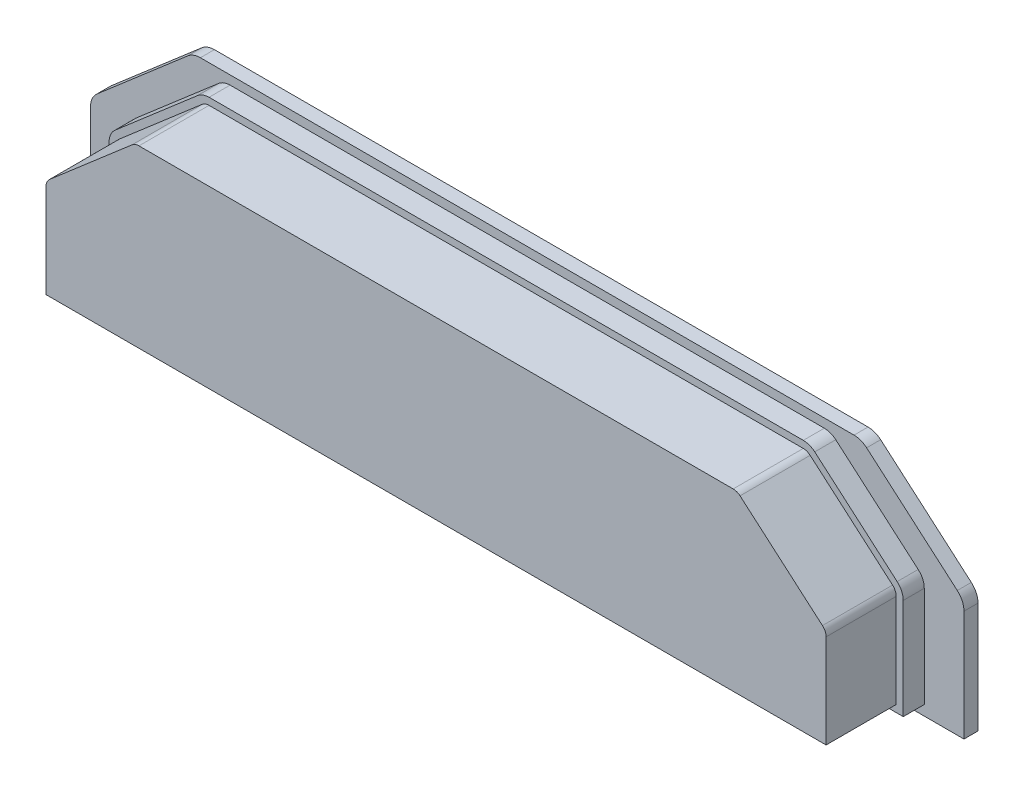
ISO-10303-21;
HEADER;
FILE_DESCRIPTION(('STEP AP214'),'2;1');
FILE_NAME('part.step','',(''),(''),'','','');
FILE_SCHEMA(('AUTOMOTIVE_DESIGN { 1 0 10303 214 1 1 1 1 }'));
ENDSEC;
DATA;
#1=APPLICATION_CONTEXT('core data for automotive mechanical design processes');
#2=APPLICATION_PROTOCOL_DEFINITION('international standard','automotive_design',2000,#1);
#3=PRODUCT_CONTEXT('',#1,'mechanical');
#4=PRODUCT('Part','Part','',(#3));
#5=PRODUCT_RELATED_PRODUCT_CATEGORY('part','',(#4));
#6=PRODUCT_DEFINITION_FORMATION('','',#4);
#7=PRODUCT_DEFINITION_CONTEXT('part definition',#1,'design');
#8=PRODUCT_DEFINITION('design','',#6,#7);
#9=PRODUCT_DEFINITION_SHAPE('','',#8);
#10=(LENGTH_UNIT() NAMED_UNIT(*) SI_UNIT(.MILLI.,.METRE.));
#11=(NAMED_UNIT(*) PLANE_ANGLE_UNIT() SI_UNIT($,.RADIAN.));
#12=(NAMED_UNIT(*) SI_UNIT($,.STERADIAN.) SOLID_ANGLE_UNIT());
#13=UNCERTAINTY_MEASURE_WITH_UNIT(LENGTH_MEASURE(1.E-05),#10,'distance_accuracy_value','');
#14=(GEOMETRIC_REPRESENTATION_CONTEXT(3) GLOBAL_UNCERTAINTY_ASSIGNED_CONTEXT((#13)) GLOBAL_UNIT_ASSIGNED_CONTEXT((#10,
#11,#12)) REPRESENTATION_CONTEXT('',''));
#15=CARTESIAN_POINT('',(0.,0.,0.));
#16=DIRECTION('',(0.,0.,1.));
#17=DIRECTION('',(1.,0.,0.));
#18=AXIS2_PLACEMENT_3D('',#15,#16,#17);
#19=CARTESIAN_POINT('',(56.625,-26.9999999999999,3.));
#20=DIRECTION('',(-1.,0.,0.));
#21=DIRECTION('',(0.,0.,1.));
#22=AXIS2_PLACEMENT_3D('',#19,#20,#21);
#23=PLANE('',#22);
#24=DIRECTION('',(0.,1.,0.));
#25=VECTOR('',#24,1.);
#26=CARTESIAN_POINT('',(56.625,-26.9999999999999,0.));
#27=LINE('',#26,#25);
#28=CARTESIAN_POINT('',(56.625,-26.9999999999999,0.));
#29=VERTEX_POINT('',#28);
#30=CARTESIAN_POINT('',(56.625,-12.6446300735362,0.));
#31=VERTEX_POINT('',#30);
#32=EDGE_CURVE('E378',#29,#31,#27,.T.);
#33=ORIENTED_EDGE('',*,*,#32,.T.);
#34=DIRECTION('',(0.,0.,-1.));
#35=VECTOR('',#34,1.);
#36=CARTESIAN_POINT('',(56.625,-12.6446300735362,3.));
#37=LINE('',#36,#35);
#38=CARTESIAN_POINT('',(56.625,-12.6446300735362,3.));
#39=VERTEX_POINT('',#38);
#40=EDGE_CURVE('E11',#39,#31,#37,.T.);
#41=ORIENTED_EDGE('',*,*,#40,.F.);
#42=DIRECTION('',(0.,1.,0.));
#43=VECTOR('',#42,1.);
#44=CARTESIAN_POINT('',(56.625,-26.9999999999999,3.));
#45=LINE('',#44,#43);
#46=CARTESIAN_POINT('',(56.625,-26.9999999999999,3.));
#47=VERTEX_POINT('',#46);
#48=EDGE_CURVE('E379',#47,#39,#45,.T.);
#49=ORIENTED_EDGE('',*,*,#48,.F.);
#50=DIRECTION('',(0.,0.,-1.));
#51=VECTOR('',#50,1.);
#52=CARTESIAN_POINT('',(56.625,-26.9999999999999,3.));
#53=LINE('',#52,#51);
#54=EDGE_CURVE('E411',#47,#29,#53,.T.);
#55=ORIENTED_EDGE('',*,*,#54,.T.);
#56=EDGE_LOOP('',(#33,#41,#49,#55));
#57=FACE_BOUND('',#56,.T.);
#58=ADVANCED_FACE('F43',(#57),#23,.F.);
#59=CARTESIAN_POINT('',(54.125,-12.6446300735362,3.));
#60=DIRECTION('',(0.,0.,-1.));
#61=DIRECTION('',(-1.,0.,0.));
#62=AXIS2_PLACEMENT_3D('',#59,#60,#61);
#63=CYLINDRICAL_SURFACE('',#62,2.5);
#64=CARTESIAN_POINT('',(54.125,-12.6446300735362,0.));
#65=DIRECTION('',(0.,0.,1.));
#66=DIRECTION('',(1.,0.,0.));
#67=AXIS2_PLACEMENT_3D('',#64,#65,#66);
#68=CIRCLE('',#67,2.5);
#69=CARTESIAN_POINT('',(55.7585005575696,-10.752098454667,0.));
#70=VERTEX_POINT('',#69);
#71=EDGE_CURVE('E415',#31,#70,#68,.T.);
#72=ORIENTED_EDGE('',*,*,#71,.T.);
#73=DIRECTION('',(0.,0.,-1.));
#74=VECTOR('',#73,1.);
#75=CARTESIAN_POINT('',(55.7585005575696,-10.752098454667,3.));
#76=LINE('',#75,#74);
#77=CARTESIAN_POINT('',(55.7585005575696,-10.752098454667,3.));
#78=VERTEX_POINT('',#77);
#79=EDGE_CURVE('E51',#78,#70,#76,.T.);
#80=ORIENTED_EDGE('',*,*,#79,.F.);
#81=CARTESIAN_POINT('',(54.125,-12.6446300735362,3.));
#82=DIRECTION('',(0.,0.,1.));
#83=DIRECTION('',(1.,0.,0.));
#84=AXIS2_PLACEMENT_3D('',#81,#82,#83);
#85=CIRCLE('',#84,2.5);
#86=EDGE_CURVE('E383',#39,#78,#85,.T.);
#87=ORIENTED_EDGE('',*,*,#86,.F.);
#88=ORIENTED_EDGE('',*,*,#40,.T.);
#89=EDGE_LOOP('',(#72,#80,#87,#88));
#90=FACE_BOUND('',#89,.T.);
#91=ADVANCED_FACE('F488',(#90),#63,.T.);
#92=CARTESIAN_POINT('',(55.7585005575696,-10.752098454667,3.));
#93=DIRECTION('',(-0.653400223027825,-0.757012647547707,0.));
#94=DIRECTION('',(0.757012647547707,-0.653400223027825,0.));
#95=AXIS2_PLACEMENT_3D('',#92,#93,#94);
#96=PLANE('',#95);
#97=DIRECTION('',(-0.757012647547707,0.653400223027825,0.));
#98=VECTOR('',#97,1.);
#99=CARTESIAN_POINT('',(55.7585005575696,-10.752098454667,0.));
#100=LINE('',#99,#98);
#101=CARTESIAN_POINT('',(44.0051937791102,-0.607468381130697,0.));
#102=VERTEX_POINT('',#101);
#103=EDGE_CURVE('E419',#70,#102,#100,.T.);
#104=ORIENTED_EDGE('',*,*,#103,.T.);
#105=DIRECTION('',(0.,0.,-1.));
#106=VECTOR('',#105,1.);
#107=CARTESIAN_POINT('',(44.0051937791102,-0.607468381130697,3.));
#108=LINE('',#107,#106);
#109=CARTESIAN_POINT('',(44.0051937791102,-0.607468381130697,3.));
#110=VERTEX_POINT('',#109);
#111=EDGE_CURVE('E477',#110,#102,#108,.T.);
#112=ORIENTED_EDGE('',*,*,#111,.F.);
#113=DIRECTION('',(-0.757012647547707,0.653400223027825,0.));
#114=VECTOR('',#113,1.);
#115=CARTESIAN_POINT('',(55.7585005575696,-10.752098454667,3.));
#116=LINE('',#115,#114);
#117=EDGE_CURVE('E387',#78,#110,#116,.T.);
#118=ORIENTED_EDGE('',*,*,#117,.F.);
#119=ORIENTED_EDGE('',*,*,#79,.T.);
#120=EDGE_LOOP('',(#104,#112,#118,#119));
#121=FACE_BOUND('',#120,.T.);
#122=ADVANCED_FACE('F485',(#121),#96,.F.);
#123=CARTESIAN_POINT('',(42.3716932215407,-2.49999999999995,3.));
#124=DIRECTION('',(0.,0.,-1.));
#125=DIRECTION('',(-1.,0.,0.));
#126=AXIS2_PLACEMENT_3D('',#123,#124,#125);
#127=CYLINDRICAL_SURFACE('',#126,2.49999999999997);
#128=CARTESIAN_POINT('',(42.3716932215407,-2.49999999999995,0.));
#129=DIRECTION('',(0.,0.,1.));
#130=DIRECTION('',(1.,0.,0.));
#131=AXIS2_PLACEMENT_3D('',#128,#129,#130);
#132=CIRCLE('',#131,2.49999999999997);
#133=CARTESIAN_POINT('',(42.3716932215407,0.,0.));
#134=VERTEX_POINT('',#133);
#135=EDGE_CURVE('E423',#102,#134,#132,.T.);
#136=ORIENTED_EDGE('',*,*,#135,.T.);
#137=DIRECTION('',(0.,0.,-1.));
#138=VECTOR('',#137,1.);
#139=CARTESIAN_POINT('',(42.3716932215407,0.,3.));
#140=LINE('',#139,#138);
#141=CARTESIAN_POINT('',(42.3716932215407,0.,3.));
#142=VERTEX_POINT('',#141);
#143=EDGE_CURVE('E473',#142,#134,#140,.T.);
#144=ORIENTED_EDGE('',*,*,#143,.F.);
#145=CARTESIAN_POINT('',(42.3716932215407,-2.49999999999995,3.));
#146=DIRECTION('',(0.,0.,1.));
#147=DIRECTION('',(1.,0.,0.));
#148=AXIS2_PLACEMENT_3D('',#145,#146,#147);
#149=CIRCLE('',#148,2.49999999999997);
#150=EDGE_CURVE('E390',#110,#142,#149,.T.);
#151=ORIENTED_EDGE('',*,*,#150,.F.);
#152=ORIENTED_EDGE('',*,*,#111,.T.);
#153=EDGE_LOOP('',(#136,#144,#151,#152));
#154=FACE_BOUND('',#153,.T.);
#155=ADVANCED_FACE('F495',(#154),#127,.T.);
#156=CARTESIAN_POINT('',(42.3716932215407,0.,3.));
#157=DIRECTION('',(0.,-1.,0.));
#158=DIRECTION('',(1.,0.,0.));
#159=AXIS2_PLACEMENT_3D('',#156,#157,#158);
#160=PLANE('',#159);
#161=DIRECTION('',(-1.,0.,0.));
#162=VECTOR('',#161,1.);
#163=CARTESIAN_POINT('',(42.3716932215407,0.,0.));
#164=LINE('',#163,#162);
#165=CARTESIAN_POINT('',(-42.3716932215407,0.,0.));
#166=VERTEX_POINT('',#165);
#167=EDGE_CURVE('E427',#134,#166,#164,.T.);
#168=ORIENTED_EDGE('',*,*,#167,.T.);
#169=DIRECTION('',(0.,0.,-1.));
#170=VECTOR('',#169,1.);
#171=CARTESIAN_POINT('',(-42.3716932215407,0.,3.));
#172=LINE('',#171,#170);
#173=CARTESIAN_POINT('',(-42.3716932215407,0.,3.));
#174=VERTEX_POINT('',#173);
#175=EDGE_CURVE('E469',#174,#166,#172,.T.);
#176=ORIENTED_EDGE('',*,*,#175,.F.);
#177=DIRECTION('',(-1.,0.,0.));
#178=VECTOR('',#177,1.);
#179=CARTESIAN_POINT('',(42.3716932215407,0.,3.));
#180=LINE('',#179,#178);
#181=EDGE_CURVE('E393',#142,#174,#180,.T.);
#182=ORIENTED_EDGE('',*,*,#181,.F.);
#183=ORIENTED_EDGE('',*,*,#143,.T.);
#184=EDGE_LOOP('',(#168,#176,#182,#183));
#185=FACE_BOUND('',#184,.T.);
#186=ADVANCED_FACE('F499',(#185),#160,.F.);
#187=CARTESIAN_POINT('',(-42.3716932215407,-2.49999999999995,3.));
#188=DIRECTION('',(0.,0.,-1.));
#189=DIRECTION('',(-1.,0.,0.));
#190=AXIS2_PLACEMENT_3D('',#187,#188,#189);
#191=CYLINDRICAL_SURFACE('',#190,2.4999999999999);
#192=CARTESIAN_POINT('',(-42.3716932215407,-2.49999999999995,0.));
#193=DIRECTION('',(0.,0.,1.));
#194=DIRECTION('',(1.,0.,0.));
#195=AXIS2_PLACEMENT_3D('',#192,#193,#194);
#196=CIRCLE('',#195,2.4999999999999);
#197=CARTESIAN_POINT('',(-44.0051937791101,-0.607468381130795,0.));
#198=VERTEX_POINT('',#197);
#199=EDGE_CURVE('E431',#166,#198,#196,.T.);
#200=ORIENTED_EDGE('',*,*,#199,.T.);
#201=DIRECTION('',(0.,0.,-1.));
#202=VECTOR('',#201,1.);
#203=CARTESIAN_POINT('',(-44.0051937791101,-0.607468381130795,3.));
#204=LINE('',#203,#202);
#205=CARTESIAN_POINT('',(-44.0051937791101,-0.607468381130795,3.));
#206=VERTEX_POINT('',#205);
#207=EDGE_CURVE('E465',#206,#198,#204,.T.);
#208=ORIENTED_EDGE('',*,*,#207,.F.);
#209=CARTESIAN_POINT('',(-42.3716932215407,-2.49999999999995,3.));
#210=DIRECTION('',(0.,0.,1.));
#211=DIRECTION('',(1.,0.,0.));
#212=AXIS2_PLACEMENT_3D('',#209,#210,#211);
#213=CIRCLE('',#212,2.4999999999999);
#214=EDGE_CURVE('E396',#174,#206,#213,.T.);
#215=ORIENTED_EDGE('',*,*,#214,.F.);
#216=ORIENTED_EDGE('',*,*,#175,.T.);
#217=EDGE_LOOP('',(#200,#208,#215,#216));
#218=FACE_BOUND('',#217,.T.);
#219=ADVANCED_FACE('F524',(#218),#191,.T.);
#220=CARTESIAN_POINT('',(-44.0051937791101,-0.607468381130795,3.));
#221=DIRECTION('',(0.653400223027825,-0.757012647547707,0.));
#222=DIRECTION('',(0.757012647547707,0.653400223027825,0.));
#223=AXIS2_PLACEMENT_3D('',#220,#221,#222);
#224=PLANE('',#223);
#225=DIRECTION('',(-0.757012647547707,-0.653400223027825,0.));
#226=VECTOR('',#225,1.);
#227=CARTESIAN_POINT('',(-44.0051937791101,-0.607468381130795,0.));
#228=LINE('',#227,#226);
#229=CARTESIAN_POINT('',(-55.7585005575695,-10.752098454667,0.));
#230=VERTEX_POINT('',#229);
#231=EDGE_CURVE('E435',#198,#230,#228,.T.);
#232=ORIENTED_EDGE('',*,*,#231,.T.);
#233=DIRECTION('',(0.,0.,-1.));
#234=VECTOR('',#233,1.);
#235=CARTESIAN_POINT('',(-55.7585005575695,-10.752098454667,3.));
#236=LINE('',#235,#234);
#237=CARTESIAN_POINT('',(-55.7585005575695,-10.752098454667,3.));
#238=VERTEX_POINT('',#237);
#239=EDGE_CURVE('E461',#238,#230,#236,.T.);
#240=ORIENTED_EDGE('',*,*,#239,.F.);
#241=DIRECTION('',(-0.757012647547707,-0.653400223027825,0.));
#242=VECTOR('',#241,1.);
#243=CARTESIAN_POINT('',(-44.0051937791101,-0.607468381130795,3.));
#244=LINE('',#243,#242);
#245=EDGE_CURVE('E399',#206,#238,#244,.T.);
#246=ORIENTED_EDGE('',*,*,#245,.F.);
#247=ORIENTED_EDGE('',*,*,#207,.T.);
#248=EDGE_LOOP('',(#232,#240,#246,#247));
#249=FACE_BOUND('',#248,.T.);
#250=ADVANCED_FACE('F521',(#249),#224,.F.);
#251=CARTESIAN_POINT('',(-54.125,-12.6446300735362,3.));
#252=DIRECTION('',(0.,0.,-1.));
#253=DIRECTION('',(-1.,0.,0.));
#254=AXIS2_PLACEMENT_3D('',#251,#252,#253);
#255=CYLINDRICAL_SURFACE('',#254,2.49999999999993);
#256=CARTESIAN_POINT('',(-54.125,-12.6446300735362,0.));
#257=DIRECTION('',(0.,0.,1.));
#258=DIRECTION('',(1.,0.,0.));
#259=AXIS2_PLACEMENT_3D('',#256,#257,#258);
#260=CIRCLE('',#259,2.49999999999993);
#261=CARTESIAN_POINT('',(-56.625,-12.6446300735362,0.));
#262=VERTEX_POINT('',#261);
#263=EDGE_CURVE('E439',#230,#262,#260,.T.);
#264=ORIENTED_EDGE('',*,*,#263,.T.);
#265=DIRECTION('',(0.,0.,-1.));
#266=VECTOR('',#265,1.);
#267=CARTESIAN_POINT('',(-56.625,-12.6446300735362,3.));
#268=LINE('',#267,#266);
#269=CARTESIAN_POINT('',(-56.625,-12.6446300735362,3.));
#270=VERTEX_POINT('',#269);
#271=EDGE_CURVE('E457',#270,#262,#268,.T.);
#272=ORIENTED_EDGE('',*,*,#271,.F.);
#273=CARTESIAN_POINT('',(-54.125,-12.6446300735362,3.));
#274=DIRECTION('',(0.,0.,1.));
#275=DIRECTION('',(1.,0.,0.));
#276=AXIS2_PLACEMENT_3D('',#273,#274,#275);
#277=CIRCLE('',#276,2.49999999999993);
#278=EDGE_CURVE('E402',#238,#270,#277,.T.);
#279=ORIENTED_EDGE('',*,*,#278,.F.);
#280=ORIENTED_EDGE('',*,*,#239,.T.);
#281=EDGE_LOOP('',(#264,#272,#279,#280));
#282=FACE_BOUND('',#281,.T.);
#283=ADVANCED_FACE('F518',(#282),#255,.T.);
#284=CARTESIAN_POINT('',(-56.625,-12.6446300735362,3.));
#285=DIRECTION('',(1.,0.,0.));
#286=DIRECTION('',(0.,1.,0.));
#287=AXIS2_PLACEMENT_3D('',#284,#285,#286);
#288=PLANE('',#287);
#289=DIRECTION('',(0.,-1.,0.));
#290=VECTOR('',#289,1.);
#291=CARTESIAN_POINT('',(-56.625,-12.6446300735362,0.));
#292=LINE('',#291,#290);
#293=CARTESIAN_POINT('',(-56.625,-26.9999999999999,0.));
#294=VERTEX_POINT('',#293);
#295=EDGE_CURVE('E443',#262,#294,#292,.T.);
#296=ORIENTED_EDGE('',*,*,#295,.T.);
#297=DIRECTION('',(0.,0.,-1.));
#298=VECTOR('',#297,1.);
#299=CARTESIAN_POINT('',(-56.625,-26.9999999999999,3.));
#300=LINE('',#299,#298);
#301=CARTESIAN_POINT('',(-56.625,-26.9999999999999,3.));
#302=VERTEX_POINT('',#301);
#303=EDGE_CURVE('E453',#302,#294,#300,.T.);
#304=ORIENTED_EDGE('',*,*,#303,.F.);
#305=DIRECTION('',(0.,-1.,0.));
#306=VECTOR('',#305,1.);
#307=CARTESIAN_POINT('',(-56.625,-12.6446300735362,3.));
#308=LINE('',#307,#306);
#309=EDGE_CURVE('E405',#270,#302,#308,.T.);
#310=ORIENTED_EDGE('',*,*,#309,.F.);
#311=ORIENTED_EDGE('',*,*,#271,.T.);
#312=EDGE_LOOP('',(#296,#304,#310,#311));
#313=FACE_BOUND('',#312,.T.);
#314=ADVANCED_FACE('F513',(#313),#288,.F.);
#315=CARTESIAN_POINT('',(-56.625,-26.9999999999999,3.));
#316=DIRECTION('',(0.,1.,0.));
#317=DIRECTION('',(0.,0.,1.));
#318=AXIS2_PLACEMENT_3D('',#315,#316,#317);
#319=PLANE('',#318);
#320=DIRECTION('',(1.,0.,0.));
#321=VECTOR('',#320,1.);
#322=CARTESIAN_POINT('',(-56.625,-26.9999999999999,0.));
#323=LINE('',#322,#321);
#324=EDGE_CURVE('E384',#294,#29,#323,.T.);
#325=ORIENTED_EDGE('',*,*,#324,.T.);
#326=ORIENTED_EDGE('',*,*,#54,.F.);
#327=DIRECTION('',(1.,0.,0.));
#328=VECTOR('',#327,1.);
#329=CARTESIAN_POINT('',(-56.625,-26.9999999999999,3.));
#330=LINE('',#329,#328);
#331=EDGE_CURVE('E408',#302,#47,#330,.T.);
#332=ORIENTED_EDGE('',*,*,#331,.F.);
#333=ORIENTED_EDGE('',*,*,#303,.T.);
#334=EDGE_LOOP('',(#325,#326,#332,#333));
#335=FACE_BOUND('',#334,.T.);
#336=ADVANCED_FACE('F510',(#335),#319,.F.);
#337=CARTESIAN_POINT('',(54.125,-12.6446300735362,3.));
#338=DIRECTION('',(0.,0.,1.));
#339=DIRECTION('',(1.,0.,0.));
#340=AXIS2_PLACEMENT_3D('',#337,#338,#339);
#341=PLANE('',#340);
#342=DIRECTION('',(1.,0.,0.));
#343=VECTOR('',#342,1.);
#344=CARTESIAN_POINT('',(-55.625,-25.9999999999999,3.));
#345=LINE('',#344,#343);
#346=CARTESIAN_POINT('',(-55.625,-25.9999999999999,3.));
#347=VERTEX_POINT('',#346);
#348=CARTESIAN_POINT('',(55.625,-25.9999999999999,3.));
#349=VERTEX_POINT('',#348);
#350=EDGE_CURVE('E58',#347,#349,#345,.T.);
#351=ORIENTED_EDGE('',*,*,#350,.F.);
#352=DIRECTION('',(0.,-1.,0.));
#353=VECTOR('',#352,1.);
#354=CARTESIAN_POINT('',(-55.625,-12.6446300735362,3.));
#355=LINE('',#354,#353);
#356=CARTESIAN_POINT('',(-55.625,-12.6446300735362,3.));
#357=VERTEX_POINT('',#356);
#358=EDGE_CURVE('E62',#357,#347,#355,.T.);
#359=ORIENTED_EDGE('',*,*,#358,.F.);
#360=CARTESIAN_POINT('',(-54.125,-12.6446300735362,3.));
#361=DIRECTION('',(0.,0.,1.));
#362=DIRECTION('',(1.,0.,0.));
#363=AXIS2_PLACEMENT_3D('',#360,#361,#362);
#364=CIRCLE('',#363,1.49999999999995);
#365=CARTESIAN_POINT('',(-55.1051003345417,-11.5091111022147,3.));
#366=VERTEX_POINT('',#365);
#367=EDGE_CURVE('E334',#366,#357,#364,.T.);
#368=ORIENTED_EDGE('',*,*,#367,.F.);
#369=DIRECTION('',(-0.757012647547709,-0.653400223027822,0.));
#370=VECTOR('',#369,1.);
#371=CARTESIAN_POINT('',(-43.3517935560823,-1.36448102867848,3.));
#372=LINE('',#371,#370);
#373=CARTESIAN_POINT('',(-43.3517935560823,-1.36448102867847,3.));
#374=VERTEX_POINT('',#373);
#375=EDGE_CURVE('E330',#374,#366,#372,.T.);
#376=ORIENTED_EDGE('',*,*,#375,.F.);
#377=CARTESIAN_POINT('',(-42.3716932215407,-2.49999999999995,3.));
#378=DIRECTION('',(0.,0.,1.));
#379=DIRECTION('',(1.,0.,0.));
#380=AXIS2_PLACEMENT_3D('',#377,#378,#379);
#381=CIRCLE('',#380,1.49999999999988);
#382=CARTESIAN_POINT('',(-42.3716932215407,-1.00000000000005,3.));
#383=VERTEX_POINT('',#382);
#384=EDGE_CURVE('E326',#383,#374,#381,.T.);
#385=ORIENTED_EDGE('',*,*,#384,.F.);
#386=DIRECTION('',(-1.,0.,0.));
#387=VECTOR('',#386,1.);
#388=CARTESIAN_POINT('',(42.3716932215407,-0.999999999999981,3.));
#389=LINE('',#388,#387);
#390=CARTESIAN_POINT('',(42.3716932215407,-0.999999999999977,3.));
#391=VERTEX_POINT('',#390);
#392=EDGE_CURVE('E322',#391,#383,#389,.T.);
#393=ORIENTED_EDGE('',*,*,#392,.F.);
#394=CARTESIAN_POINT('',(42.3716932215407,-2.49999999999995,3.));
#395=DIRECTION('',(0.,0.,1.));
#396=DIRECTION('',(1.,0.,0.));
#397=AXIS2_PLACEMENT_3D('',#394,#395,#396);
#398=CIRCLE('',#397,1.49999999999997);
#399=CARTESIAN_POINT('',(43.3517935560824,-1.3644810286784,3.));
#400=VERTEX_POINT('',#399);
#401=EDGE_CURVE('E318',#400,#391,#398,.T.);
#402=ORIENTED_EDGE('',*,*,#401,.F.);
#403=DIRECTION('',(-0.757012647547707,0.653400223027824,0.));
#404=VECTOR('',#403,1.);
#405=CARTESIAN_POINT('',(55.1051003345417,-11.5091111022147,3.));
#406=LINE('',#405,#404);
#407=CARTESIAN_POINT('',(55.1051003345417,-11.5091111022147,3.));
#408=VERTEX_POINT('',#407);
#409=EDGE_CURVE('E314',#408,#400,#406,.T.);
#410=ORIENTED_EDGE('',*,*,#409,.F.);
#411=CARTESIAN_POINT('',(54.125,-12.6446300735362,3.));
#412=DIRECTION('',(0.,0.,1.));
#413=DIRECTION('',(1.,0.,0.));
#414=AXIS2_PLACEMENT_3D('',#411,#412,#413);
#415=CIRCLE('',#414,1.5);
#416=CARTESIAN_POINT('',(55.625,-12.6446300735362,3.));
#417=VERTEX_POINT('',#416);
#418=EDGE_CURVE('E310',#417,#408,#415,.T.);
#419=ORIENTED_EDGE('',*,*,#418,.F.);
#420=DIRECTION('',(0.,1.,0.));
#421=VECTOR('',#420,1.);
#422=CARTESIAN_POINT('',(55.625,-25.9999999999999,3.));
#423=LINE('',#422,#421);
#424=EDGE_CURVE('E269',#349,#417,#423,.T.);
#425=ORIENTED_EDGE('',*,*,#424,.F.);
#426=EDGE_LOOP('',(#351,#359,#368,#376,#385,#393,#402,#410,#419,#425));
#427=FACE_BOUND('',#426,.T.);
#428=ORIENTED_EDGE('',*,*,#48,.T.);
#429=ORIENTED_EDGE('',*,*,#86,.T.);
#430=ORIENTED_EDGE('',*,*,#117,.T.);
#431=ORIENTED_EDGE('',*,*,#150,.T.);
#432=ORIENTED_EDGE('',*,*,#181,.T.);
#433=ORIENTED_EDGE('',*,*,#214,.T.);
#434=ORIENTED_EDGE('',*,*,#245,.T.);
#435=ORIENTED_EDGE('',*,*,#278,.T.);
#436=ORIENTED_EDGE('',*,*,#309,.T.);
#437=ORIENTED_EDGE('',*,*,#331,.T.);
#438=EDGE_LOOP('',(#428,#429,#430,#431,#432,#433,#434,#435,#436,#437));
#439=FACE_BOUND('',#438,.T.);
#440=ADVANCED_FACE('F503',(#427,#439),#341,.T.);
#441=CARTESIAN_POINT('',(-55.625,-25.9999999999999,13.));
#442=DIRECTION('',(0.,1.,0.));
#443=DIRECTION('',(0.,0.,1.));
#444=AXIS2_PLACEMENT_3D('',#441,#442,#443);
#445=PLANE('',#444);
#446=ORIENTED_EDGE('',*,*,#350,.T.);
#447=DIRECTION('',(0.,0.,-1.));
#448=VECTOR('',#447,1.);
#449=CARTESIAN_POINT('',(55.625,-25.9999999999999,13.));
#450=LINE('',#449,#448);
#451=CARTESIAN_POINT('',(55.625,-25.9999999999999,13.));
#452=VERTEX_POINT('',#451);
#453=EDGE_CURVE('E374',#452,#349,#450,.T.);
#454=ORIENTED_EDGE('',*,*,#453,.F.);
#455=DIRECTION('',(1.,0.,0.));
#456=VECTOR('',#455,1.);
#457=CARTESIAN_POINT('',(-55.625,-25.9999999999999,13.));
#458=LINE('',#457,#456);
#459=CARTESIAN_POINT('',(-55.625,-25.9999999999999,13.));
#460=VERTEX_POINT('',#459);
#461=EDGE_CURVE('E275',#460,#452,#458,.T.);
#462=ORIENTED_EDGE('',*,*,#461,.F.);
#463=DIRECTION('',(0.,0.,-1.));
#464=VECTOR('',#463,1.);
#465=CARTESIAN_POINT('',(-55.625,-25.9999999999999,13.));
#466=LINE('',#465,#464);
#467=EDGE_CURVE('E305',#460,#347,#466,.T.);
#468=ORIENTED_EDGE('',*,*,#467,.T.);
#469=EDGE_LOOP('',(#446,#454,#462,#468));
#470=FACE_BOUND('',#469,.T.);
#471=ADVANCED_FACE('F829',(#470),#445,.F.);
#472=CARTESIAN_POINT('',(55.625,-25.9999999999999,13.));
#473=DIRECTION('',(-1.,0.,0.));
#474=DIRECTION('',(0.,0.,1.));
#475=AXIS2_PLACEMENT_3D('',#472,#473,#474);
#476=PLANE('',#475);
#477=ORIENTED_EDGE('',*,*,#424,.T.);
#478=DIRECTION('',(0.,0.,-1.));
#479=VECTOR('',#478,1.);
#480=CARTESIAN_POINT('',(55.625,-12.6446300735362,13.));
#481=LINE('',#480,#479);
#482=CARTESIAN_POINT('',(55.625,-12.6446300735362,13.));
#483=VERTEX_POINT('',#482);
#484=EDGE_CURVE('E370',#483,#417,#481,.T.);
#485=ORIENTED_EDGE('',*,*,#484,.F.);
#486=DIRECTION('',(0.,1.,0.));
#487=VECTOR('',#486,1.);
#488=CARTESIAN_POINT('',(55.625,-25.9999999999999,13.));
#489=LINE('',#488,#487);
#490=EDGE_CURVE('E279',#452,#483,#489,.T.);
#491=ORIENTED_EDGE('',*,*,#490,.F.);
#492=ORIENTED_EDGE('',*,*,#453,.T.);
#493=EDGE_LOOP('',(#477,#485,#491,#492));
#494=FACE_BOUND('',#493,.T.);
#495=ADVANCED_FACE('F819',(#494),#476,.F.);
#496=CARTESIAN_POINT('',(54.125,-12.6446300735362,13.));
#497=DIRECTION('',(0.,0.,-1.));
#498=DIRECTION('',(-1.,0.,0.));
#499=AXIS2_PLACEMENT_3D('',#496,#497,#498);
#500=CYLINDRICAL_SURFACE('',#499,1.5);
#501=ORIENTED_EDGE('',*,*,#418,.T.);
#502=DIRECTION('',(0.,0.,-1.));
#503=VECTOR('',#502,1.);
#504=CARTESIAN_POINT('',(55.1051003345417,-11.5091111022147,13.));
#505=LINE('',#504,#503);
#506=CARTESIAN_POINT('',(55.1051003345417,-11.5091111022147,13.));
#507=VERTEX_POINT('',#506);
#508=EDGE_CURVE('E366',#507,#408,#505,.T.);
#509=ORIENTED_EDGE('',*,*,#508,.F.);
#510=CARTESIAN_POINT('',(54.125,-12.6446300735362,13.));
#511=DIRECTION('',(0.,0.,1.));
#512=DIRECTION('',(1.,0.,0.));
#513=AXIS2_PLACEMENT_3D('',#510,#511,#512);
#514=CIRCLE('',#513,1.5);
#515=EDGE_CURVE('E282',#483,#507,#514,.T.);
#516=ORIENTED_EDGE('',*,*,#515,.F.);
#517=ORIENTED_EDGE('',*,*,#484,.T.);
#518=EDGE_LOOP('',(#501,#509,#516,#517));
#519=FACE_BOUND('',#518,.T.);
#520=ADVANCED_FACE('F809',(#519),#500,.T.);
#521=CARTESIAN_POINT('',(55.1051003345417,-11.5091111022147,13.));
#522=DIRECTION('',(-0.653400223027824,-0.757012647547707,0.));
#523=DIRECTION('',(0.757012647547708,-0.653400223027824,0.));
#524=AXIS2_PLACEMENT_3D('',#521,#522,#523);
#525=PLANE('',#524);
#526=ORIENTED_EDGE('',*,*,#409,.T.);
#527=DIRECTION('',(0.,0.,-1.));
#528=VECTOR('',#527,1.);
#529=CARTESIAN_POINT('',(43.3517935560824,-1.3644810286784,13.));
#530=LINE('',#529,#528);
#531=CARTESIAN_POINT('',(43.3517935560824,-1.3644810286784,13.));
#532=VERTEX_POINT('',#531);
#533=EDGE_CURVE('E362',#532,#400,#530,.T.);
#534=ORIENTED_EDGE('',*,*,#533,.F.);
#535=DIRECTION('',(-0.757012647547707,0.653400223027824,0.));
#536=VECTOR('',#535,1.);
#537=CARTESIAN_POINT('',(55.1051003345417,-11.5091111022147,13.));
#538=LINE('',#537,#536);
#539=EDGE_CURVE('E285',#507,#532,#538,.T.);
#540=ORIENTED_EDGE('',*,*,#539,.F.);
#541=ORIENTED_EDGE('',*,*,#508,.T.);
#542=EDGE_LOOP('',(#526,#534,#540,#541));
#543=FACE_BOUND('',#542,.T.);
#544=ADVANCED_FACE('F799',(#543),#525,.F.);
#545=CARTESIAN_POINT('',(42.3716932215407,-2.49999999999995,13.));
#546=DIRECTION('',(0.,0.,-1.));
#547=DIRECTION('',(-1.,0.,0.));
#548=AXIS2_PLACEMENT_3D('',#545,#546,#547);
#549=CYLINDRICAL_SURFACE('',#548,1.49999999999997);
#550=ORIENTED_EDGE('',*,*,#401,.T.);
#551=DIRECTION('',(0.,0.,-1.));
#552=VECTOR('',#551,1.);
#553=CARTESIAN_POINT('',(42.3716932215407,-0.999999999999977,13.));
#554=LINE('',#553,#552);
#555=CARTESIAN_POINT('',(42.3716932215407,-0.999999999999977,13.));
#556=VERTEX_POINT('',#555);
#557=EDGE_CURVE('E358',#556,#391,#554,.T.);
#558=ORIENTED_EDGE('',*,*,#557,.F.);
#559=CARTESIAN_POINT('',(42.3716932215407,-2.49999999999995,13.));
#560=DIRECTION('',(0.,0.,1.));
#561=DIRECTION('',(1.,0.,0.));
#562=AXIS2_PLACEMENT_3D('',#559,#560,#561);
#563=CIRCLE('',#562,1.49999999999997);
#564=EDGE_CURVE('E288',#532,#556,#563,.T.);
#565=ORIENTED_EDGE('',*,*,#564,.F.);
#566=ORIENTED_EDGE('',*,*,#533,.T.);
#567=EDGE_LOOP('',(#550,#558,#565,#566));
#568=FACE_BOUND('',#567,.T.);
#569=ADVANCED_FACE('F789',(#568),#549,.T.);
#570=CARTESIAN_POINT('',(42.3716932215407,-0.999999999999981,13.));
#571=DIRECTION('',(0.,-1.,0.));
#572=DIRECTION('',(1.,0.,0.));
#573=AXIS2_PLACEMENT_3D('',#570,#571,#572);
#574=PLANE('',#573);
#575=ORIENTED_EDGE('',*,*,#392,.T.);
#576=DIRECTION('',(0.,0.,-1.));
#577=VECTOR('',#576,1.);
#578=CARTESIAN_POINT('',(-42.3716932215407,-1.00000000000005,13.));
#579=LINE('',#578,#577);
#580=CARTESIAN_POINT('',(-42.3716932215407,-1.00000000000005,13.));
#581=VERTEX_POINT('',#580);
#582=EDGE_CURVE('E354',#581,#383,#579,.T.);
#583=ORIENTED_EDGE('',*,*,#582,.F.);
#584=DIRECTION('',(-1.,0.,0.));
#585=VECTOR('',#584,1.);
#586=CARTESIAN_POINT('',(42.3716932215407,-0.999999999999981,13.));
#587=LINE('',#586,#585);
#588=EDGE_CURVE('E291',#556,#581,#587,.T.);
#589=ORIENTED_EDGE('',*,*,#588,.F.);
#590=ORIENTED_EDGE('',*,*,#557,.T.);
#591=EDGE_LOOP('',(#575,#583,#589,#590));
#592=FACE_BOUND('',#591,.T.);
#593=ADVANCED_FACE('F779',(#592),#574,.F.);
#594=CARTESIAN_POINT('',(-42.3716932215407,-2.49999999999995,13.));
#595=DIRECTION('',(0.,0.,-1.));
#596=DIRECTION('',(-1.,0.,0.));
#597=AXIS2_PLACEMENT_3D('',#594,#595,#596);
#598=CYLINDRICAL_SURFACE('',#597,1.49999999999988);
#599=ORIENTED_EDGE('',*,*,#384,.T.);
#600=DIRECTION('',(0.,0.,-1.));
#601=VECTOR('',#600,1.);
#602=CARTESIAN_POINT('',(-43.3517935560823,-1.36448102867847,13.));
#603=LINE('',#602,#601);
#604=CARTESIAN_POINT('',(-43.3517935560823,-1.36448102867847,13.));
#605=VERTEX_POINT('',#604);
#606=EDGE_CURVE('E350',#605,#374,#603,.T.);
#607=ORIENTED_EDGE('',*,*,#606,.F.);
#608=CARTESIAN_POINT('',(-42.3716932215407,-2.49999999999995,13.));
#609=DIRECTION('',(0.,0.,1.));
#610=DIRECTION('',(1.,0.,0.));
#611=AXIS2_PLACEMENT_3D('',#608,#609,#610);
#612=CIRCLE('',#611,1.49999999999988);
#613=EDGE_CURVE('E294',#581,#605,#612,.T.);
#614=ORIENTED_EDGE('',*,*,#613,.F.);
#615=ORIENTED_EDGE('',*,*,#582,.T.);
#616=EDGE_LOOP('',(#599,#607,#614,#615));
#617=FACE_BOUND('',#616,.T.);
#618=ADVANCED_FACE('F769',(#617),#598,.T.);
#619=CARTESIAN_POINT('',(-43.3517935560823,-1.36448102867848,13.));
#620=DIRECTION('',(0.653400223027822,-0.757012647547709,0.));
#621=DIRECTION('',(0.757012647547709,0.653400223027822,0.));
#622=AXIS2_PLACEMENT_3D('',#619,#620,#621);
#623=PLANE('',#622);
#624=ORIENTED_EDGE('',*,*,#375,.T.);
#625=DIRECTION('',(0.,0.,-1.));
#626=VECTOR('',#625,1.);
#627=CARTESIAN_POINT('',(-55.1051003345417,-11.5091111022147,13.));
#628=LINE('',#627,#626);
#629=CARTESIAN_POINT('',(-55.1051003345417,-11.5091111022147,13.));
#630=VERTEX_POINT('',#629);
#631=EDGE_CURVE('E346',#630,#366,#628,.T.);
#632=ORIENTED_EDGE('',*,*,#631,.F.);
#633=DIRECTION('',(-0.757012647547709,-0.653400223027822,0.));
#634=VECTOR('',#633,1.);
#635=CARTESIAN_POINT('',(-43.3517935560823,-1.36448102867848,13.));
#636=LINE('',#635,#634);
#637=EDGE_CURVE('E297',#605,#630,#636,.T.);
#638=ORIENTED_EDGE('',*,*,#637,.F.);
#639=ORIENTED_EDGE('',*,*,#606,.T.);
#640=EDGE_LOOP('',(#624,#632,#638,#639));
#641=FACE_BOUND('',#640,.T.);
#642=ADVANCED_FACE('F759',(#641),#623,.F.);
#643=CARTESIAN_POINT('',(-54.125,-12.6446300735362,13.));
#644=DIRECTION('',(0.,0.,-1.));
#645=DIRECTION('',(-1.,0.,0.));
#646=AXIS2_PLACEMENT_3D('',#643,#644,#645);
#647=CYLINDRICAL_SURFACE('',#646,1.49999999999995);
#648=ORIENTED_EDGE('',*,*,#367,.T.);
#649=DIRECTION('',(0.,0.,-1.));
#650=VECTOR('',#649,1.);
#651=CARTESIAN_POINT('',(-55.625,-12.6446300735362,13.));
#652=LINE('',#651,#650);
#653=CARTESIAN_POINT('',(-55.625,-12.6446300735362,13.));
#654=VERTEX_POINT('',#653);
#655=EDGE_CURVE('E342',#654,#357,#652,.T.);
#656=ORIENTED_EDGE('',*,*,#655,.F.);
#657=CARTESIAN_POINT('',(-54.125,-12.6446300735362,13.));
#658=DIRECTION('',(0.,0.,1.));
#659=DIRECTION('',(1.,0.,0.));
#660=AXIS2_PLACEMENT_3D('',#657,#658,#659);
#661=CIRCLE('',#660,1.49999999999995);
#662=EDGE_CURVE('E300',#630,#654,#661,.T.);
#663=ORIENTED_EDGE('',*,*,#662,.F.);
#664=ORIENTED_EDGE('',*,*,#631,.T.);
#665=EDGE_LOOP('',(#648,#656,#663,#664));
#666=FACE_BOUND('',#665,.T.);
#667=ADVANCED_FACE('F749',(#666),#647,.T.);
#668=CARTESIAN_POINT('',(-55.625,-12.6446300735362,13.));
#669=DIRECTION('',(1.,0.,0.));
#670=DIRECTION('',(0.,1.,0.));
#671=AXIS2_PLACEMENT_3D('',#668,#669,#670);
#672=PLANE('',#671);
#673=ORIENTED_EDGE('',*,*,#358,.T.);
#674=ORIENTED_EDGE('',*,*,#467,.F.);
#675=DIRECTION('',(0.,-1.,0.));
#676=VECTOR('',#675,1.);
#677=CARTESIAN_POINT('',(-55.625,-12.6446300735362,13.));
#678=LINE('',#677,#676);
#679=EDGE_CURVE('E303',#654,#460,#678,.T.);
#680=ORIENTED_EDGE('',*,*,#679,.F.);
#681=ORIENTED_EDGE('',*,*,#655,.T.);
#682=EDGE_LOOP('',(#673,#674,#680,#681));
#683=FACE_BOUND('',#682,.T.);
#684=ADVANCED_FACE('F739',(#683),#672,.F.);
#685=CARTESIAN_POINT('',(54.125,-12.6446300735362,13.));
#686=DIRECTION('',(0.,0.,1.));
#687=DIRECTION('',(1.,0.,0.));
#688=AXIS2_PLACEMENT_3D('',#685,#686,#687);
#689=PLANE('',#688);
#690=ORIENTED_EDGE('',*,*,#461,.T.);
#691=ORIENTED_EDGE('',*,*,#490,.T.);
#692=ORIENTED_EDGE('',*,*,#515,.T.);
#693=ORIENTED_EDGE('',*,*,#539,.T.);
#694=ORIENTED_EDGE('',*,*,#564,.T.);
#695=ORIENTED_EDGE('',*,*,#588,.T.);
#696=ORIENTED_EDGE('',*,*,#613,.T.);
#697=ORIENTED_EDGE('',*,*,#637,.T.);
#698=ORIENTED_EDGE('',*,*,#662,.T.);
#699=ORIENTED_EDGE('',*,*,#679,.T.);
#700=EDGE_LOOP('',(#690,#691,#692,#693,#694,#695,#696,#697,#698,#699));
#701=FACE_BOUND('',#700,.T.);
#702=ADVANCED_FACE('F602',(#701),#689,.T.);
#703=CARTESIAN_POINT('',(59.5375,-12.6446300735362,-2.));
#704=DIRECTION('',(0.,0.,1.));
#705=DIRECTION('',(1.,0.,0.));
#706=AXIS2_PLACEMENT_3D('',#703,#704,#705);
#707=CYLINDRICAL_SURFACE('',#706,2.75);
#708=CARTESIAN_POINT('',(59.5375,-12.6446300735362,0.));
#709=DIRECTION('',(0.,0.,-1.));
#710=DIRECTION('',(-1.,0.,0.));
#711=AXIS2_PLACEMENT_3D('',#708,#709,#710);
#712=CIRCLE('',#711,2.75);
#713=CARTESIAN_POINT('',(61.3343506133265,-10.56284529278,0.));
#714=VERTEX_POINT('',#713);
#715=CARTESIAN_POINT('',(62.2875,-12.6446300735362,0.));
#716=VERTEX_POINT('',#715);
#717=EDGE_CURVE('E264',#714,#716,#712,.T.);
#718=ORIENTED_EDGE('',*,*,#717,.T.);
#719=DIRECTION('',(0.,0.,1.));
#720=VECTOR('',#719,1.);
#721=CARTESIAN_POINT('',(62.2875,-12.6446300735362,-2.));
#722=LINE('',#721,#720);
#723=CARTESIAN_POINT('',(62.2875,-12.6446300735362,-2.));
#724=VERTEX_POINT('',#723);
#725=EDGE_CURVE('E242',#724,#716,#722,.T.);
#726=ORIENTED_EDGE('',*,*,#725,.F.);
#727=CARTESIAN_POINT('',(59.5375,-12.6446300735362,-2.));
#728=DIRECTION('',(0.,0.,-1.));
#729=DIRECTION('',(-1.,0.,0.));
#730=AXIS2_PLACEMENT_3D('',#727,#728,#729);
#731=CIRCLE('',#730,2.75);
#732=CARTESIAN_POINT('',(61.3343506133265,-10.56284529278,-2.));
#733=VERTEX_POINT('',#732);
#734=EDGE_CURVE('E250',#733,#724,#731,.T.);
#735=ORIENTED_EDGE('',*,*,#734,.F.);
#736=DIRECTION('',(0.,0.,1.));
#737=VECTOR('',#736,1.);
#738=CARTESIAN_POINT('',(61.3343506133265,-10.56284529278,-2.));
#739=LINE('',#738,#737);
#740=EDGE_CURVE('E922',#733,#714,#739,.T.);
#741=ORIENTED_EDGE('',*,*,#740,.T.);
#742=EDGE_LOOP('',(#718,#726,#735,#741));
#743=FACE_BOUND('',#742,.T.);
#744=ADVANCED_FACE('F262',(#743),#707,.T.);
#745=CARTESIAN_POINT('',(62.2875,-12.6446300735362,-2.));
#746=DIRECTION('',(-1.,0.,0.));
#747=DIRECTION('',(0.,0.,1.));
#748=AXIS2_PLACEMENT_3D('',#745,#746,#747);
#749=PLANE('',#748);
#750=DIRECTION('',(0.,-1.,0.));
#751=VECTOR('',#750,1.);
#752=CARTESIAN_POINT('',(62.2875,-12.6446300735362,0.));
#753=LINE('',#752,#751);
#754=CARTESIAN_POINT('',(62.2875,-28.4355369926463,0.));
#755=VERTEX_POINT('',#754);
#756=EDGE_CURVE('E932',#716,#755,#753,.T.);
#757=ORIENTED_EDGE('',*,*,#756,.T.);
#758=DIRECTION('',(0.,0.,1.));
#759=VECTOR('',#758,1.);
#760=CARTESIAN_POINT('',(62.2875,-28.4355369926463,-2.));
#761=LINE('',#760,#759);
#762=CARTESIAN_POINT('',(62.2875,-28.4355369926463,-2.));
#763=VERTEX_POINT('',#762);
#764=EDGE_CURVE('E245',#763,#755,#761,.T.);
#765=ORIENTED_EDGE('',*,*,#764,.F.);
#766=DIRECTION('',(0.,-1.,0.));
#767=VECTOR('',#766,1.);
#768=CARTESIAN_POINT('',(62.2875,-12.6446300735362,-2.));
#769=LINE('',#768,#767);
#770=EDGE_CURVE('E238',#724,#763,#769,.T.);
#771=ORIENTED_EDGE('',*,*,#770,.F.);
#772=ORIENTED_EDGE('',*,*,#725,.T.);
#773=EDGE_LOOP('',(#757,#765,#771,#772));
#774=FACE_BOUND('',#773,.T.);
#775=ADVANCED_FACE('F240',(#774),#749,.F.);
#776=CARTESIAN_POINT('',(62.2875,-28.4355369926463,-2.));
#777=DIRECTION('',(0.,1.,0.));
#778=DIRECTION('',(0.,0.,1.));
#779=AXIS2_PLACEMENT_3D('',#776,#777,#778);
#780=PLANE('',#779);
#781=DIRECTION('',(-1.,0.,0.));
#782=VECTOR('',#781,1.);
#783=CARTESIAN_POINT('',(62.2875,-28.4355369926463,0.));
#784=LINE('',#783,#782);
#785=CARTESIAN_POINT('',(-62.2875,-28.4355369926463,0.));
#786=VERTEX_POINT('',#785);
#787=EDGE_CURVE('E936',#755,#786,#784,.T.);
#788=ORIENTED_EDGE('',*,*,#787,.T.);
#789=DIRECTION('',(0.,0.,1.));
#790=VECTOR('',#789,1.);
#791=CARTESIAN_POINT('',(-62.2875,-28.4355369926463,-2.));
#792=LINE('',#791,#790);
#793=CARTESIAN_POINT('',(-62.2875,-28.4355369926463,-2.));
#794=VERTEX_POINT('',#793);
#795=EDGE_CURVE('E271',#794,#786,#792,.T.);
#796=ORIENTED_EDGE('',*,*,#795,.F.);
#797=DIRECTION('',(-1.,0.,0.));
#798=VECTOR('',#797,1.);
#799=CARTESIAN_POINT('',(62.2875,-28.4355369926463,-2.));
#800=LINE('',#799,#798);
#801=EDGE_CURVE('E249',#763,#794,#800,.T.);
#802=ORIENTED_EDGE('',*,*,#801,.F.);
#803=ORIENTED_EDGE('',*,*,#764,.T.);
#804=EDGE_LOOP('',(#788,#796,#802,#803));
#805=FACE_BOUND('',#804,.T.);
#806=ADVANCED_FACE('F614',(#805),#780,.F.);
#807=CARTESIAN_POINT('',(-62.2875,-28.4355369926463,-2.));
#808=DIRECTION('',(1.,0.,0.));
#809=DIRECTION('',(0.,1.,0.));
#810=AXIS2_PLACEMENT_3D('',#807,#808,#809);
#811=PLANE('',#810);
#812=DIRECTION('',(0.,1.,0.));
#813=VECTOR('',#812,1.);
#814=CARTESIAN_POINT('',(-62.2875,-28.4355369926463,0.));
#815=LINE('',#814,#813);
#816=CARTESIAN_POINT('',(-62.2875,-12.6446300735362,0.));
#817=VERTEX_POINT('',#816);
#818=EDGE_CURVE('E943',#786,#817,#815,.T.);
#819=ORIENTED_EDGE('',*,*,#818,.T.);
#820=DIRECTION('',(0.,0.,1.));
#821=VECTOR('',#820,1.);
#822=CARTESIAN_POINT('',(-62.2875,-12.6446300735362,-2.));
#823=LINE('',#822,#821);
#824=CARTESIAN_POINT('',(-62.2875,-12.6446300735362,-2.));
#825=VERTEX_POINT('',#824);
#826=EDGE_CURVE('E978',#825,#817,#823,.T.);
#827=ORIENTED_EDGE('',*,*,#826,.F.);
#828=DIRECTION('',(0.,1.,0.));
#829=VECTOR('',#828,1.);
#830=CARTESIAN_POINT('',(-62.2875,-28.4355369926463,-2.));
#831=LINE('',#830,#829);
#832=EDGE_CURVE('E987',#794,#825,#831,.T.);
#833=ORIENTED_EDGE('',*,*,#832,.F.);
#834=ORIENTED_EDGE('',*,*,#795,.T.);
#835=EDGE_LOOP('',(#819,#827,#833,#834));
#836=FACE_BOUND('',#835,.T.);
#837=ADVANCED_FACE('F624',(#836),#811,.F.);
#838=CARTESIAN_POINT('',(-59.5375,-12.6446300735362,-2.));
#839=DIRECTION('',(0.,0.,1.));
#840=DIRECTION('',(1.,0.,0.));
#841=AXIS2_PLACEMENT_3D('',#838,#839,#840);
#842=CYLINDRICAL_SURFACE('',#841,2.74999999999996);
#843=CARTESIAN_POINT('',(-59.5375,-12.6446300735362,0.));
#844=DIRECTION('',(0.,0.,-1.));
#845=DIRECTION('',(-1.,0.,0.));
#846=AXIS2_PLACEMENT_3D('',#843,#844,#845);
#847=CIRCLE('',#846,2.74999999999996);
#848=CARTESIAN_POINT('',(-61.3343506133265,-10.5628452927801,0.));
#849=VERTEX_POINT('',#848);
#850=EDGE_CURVE('E946',#817,#849,#847,.T.);
#851=ORIENTED_EDGE('',*,*,#850,.T.);
#852=DIRECTION('',(0.,0.,1.));
#853=VECTOR('',#852,1.);
#854=CARTESIAN_POINT('',(-61.3343506133265,-10.5628452927801,-2.));
#855=LINE('',#854,#853);
#856=CARTESIAN_POINT('',(-61.3343506133265,-10.5628452927801,-2.));
#857=VERTEX_POINT('',#856);
#858=EDGE_CURVE('E974',#857,#849,#855,.T.);
#859=ORIENTED_EDGE('',*,*,#858,.F.);
#860=CARTESIAN_POINT('',(-59.5375,-12.6446300735362,-2.));
#861=DIRECTION('',(0.,0.,-1.));
#862=DIRECTION('',(-1.,0.,0.));
#863=AXIS2_PLACEMENT_3D('',#860,#861,#862);
#864=CIRCLE('',#863,2.74999999999996);
#865=EDGE_CURVE('E999',#825,#857,#864,.T.);
#866=ORIENTED_EDGE('',*,*,#865,.F.);
#867=ORIENTED_EDGE('',*,*,#826,.T.);
#868=EDGE_LOOP('',(#851,#859,#866,#867));
#869=FACE_BOUND('',#868,.T.);
#870=ADVANCED_FACE('F635',(#869),#842,.T.);
#871=CARTESIAN_POINT('',(-61.3343506133265,-10.5628452927801,-2.));
#872=DIRECTION('',(0.653400223027821,-0.75701264754771,0.));
#873=DIRECTION('',(0.75701264754771,0.653400223027821,0.));
#874=AXIS2_PLACEMENT_3D('',#871,#872,#873);
#875=PLANE('',#874);
#876=DIRECTION('',(0.75701264754771,0.653400223027821,0.));
#877=VECTOR('',#876,1.);
#878=CARTESIAN_POINT('',(-61.3343506133265,-10.5628452927801,0.));
#879=LINE('',#878,#877);
#880=CARTESIAN_POINT('',(-48.4057131570212,0.596247788109749,0.));
#881=VERTEX_POINT('',#880);
#882=EDGE_CURVE('E949',#849,#881,#879,.T.);
#883=ORIENTED_EDGE('',*,*,#882,.T.);
#884=DIRECTION('',(0.,0.,1.));
#885=VECTOR('',#884,1.);
#886=CARTESIAN_POINT('',(-48.4057131570212,0.596247788109749,-2.));
#887=LINE('',#886,#885);
#888=CARTESIAN_POINT('',(-48.4057131570212,0.596247788109749,-2.));
#889=VERTEX_POINT('',#888);
#890=EDGE_CURVE('E970',#889,#881,#887,.T.);
#891=ORIENTED_EDGE('',*,*,#890,.F.);
#892=DIRECTION('',(0.75701264754771,0.653400223027821,0.));
#893=VECTOR('',#892,1.);
#894=CARTESIAN_POINT('',(-61.3343506133265,-10.5628452927801,-2.));
#895=LINE('',#894,#893);
#896=EDGE_CURVE('E995',#857,#889,#895,.T.);
#897=ORIENTED_EDGE('',*,*,#896,.F.);
#898=ORIENTED_EDGE('',*,*,#858,.T.);
#899=EDGE_LOOP('',(#883,#891,#897,#898));
#900=FACE_BOUND('',#899,.T.);
#901=ADVANCED_FACE('F646',(#900),#875,.F.);
#902=CARTESIAN_POINT('',(-46.6088625436947,-1.48553699264632,-2.));
#903=DIRECTION('',(0.,0.,1.));
#904=DIRECTION('',(1.,0.,0.));
#905=AXIS2_PLACEMENT_3D('',#902,#903,#904);
#906=CYLINDRICAL_SURFACE('',#905,2.74999999999986);
#907=CARTESIAN_POINT('',(-46.6088625436947,-1.48553699264632,0.));
#908=DIRECTION('',(0.,0.,-1.));
#909=DIRECTION('',(-1.,0.,0.));
#910=AXIS2_PLACEMENT_3D('',#907,#908,#909);
#911=CIRCLE('',#910,2.74999999999986);
#912=CARTESIAN_POINT('',(-46.6088625436947,1.26446300735354,0.));
#913=VERTEX_POINT('',#912);
#914=EDGE_CURVE('E952',#881,#913,#911,.T.);
#915=ORIENTED_EDGE('',*,*,#914,.T.);
#916=DIRECTION('',(0.,0.,1.));
#917=VECTOR('',#916,1.);
#918=CARTESIAN_POINT('',(-46.6088625436947,1.26446300735354,-2.));
#919=LINE('',#918,#917);
#920=CARTESIAN_POINT('',(-46.6088625436947,1.26446300735354,-2.));
#921=VERTEX_POINT('',#920);
#922=EDGE_CURVE('E966',#921,#913,#919,.T.);
#923=ORIENTED_EDGE('',*,*,#922,.F.);
#924=CARTESIAN_POINT('',(-46.6088625436947,-1.48553699264632,-2.));
#925=DIRECTION('',(0.,0.,-1.));
#926=DIRECTION('',(-1.,0.,0.));
#927=AXIS2_PLACEMENT_3D('',#924,#925,#926);
#928=CIRCLE('',#927,2.74999999999986);
#929=EDGE_CURVE('E998',#889,#921,#928,.T.);
#930=ORIENTED_EDGE('',*,*,#929,.F.);
#931=ORIENTED_EDGE('',*,*,#890,.T.);
#932=EDGE_LOOP('',(#915,#923,#930,#931));
#933=FACE_BOUND('',#932,.T.);
#934=ADVANCED_FACE('F657',(#933),#906,.T.);
#935=CARTESIAN_POINT('',(-46.6088625436947,1.26446300735357,-2.));
#936=DIRECTION('',(0.,-1.,0.));
#937=DIRECTION('',(1.,0.,0.));
#938=AXIS2_PLACEMENT_3D('',#935,#936,#937);
#939=PLANE('',#938);
#940=DIRECTION('',(1.,0.,0.));
#941=VECTOR('',#940,1.);
#942=CARTESIAN_POINT('',(-46.6088625436947,1.26446300735357,0.));
#943=LINE('',#942,#941);
#944=CARTESIAN_POINT('',(46.6088625436947,1.26446300735363,0.));
#945=VERTEX_POINT('',#944);
#946=EDGE_CURVE('E955',#913,#945,#943,.T.);
#947=ORIENTED_EDGE('',*,*,#946,.T.);
#948=DIRECTION('',(0.,0.,1.));
#949=VECTOR('',#948,1.);
#950=CARTESIAN_POINT('',(46.6088625436947,1.26446300735363,-2.));
#951=LINE('',#950,#949);
#952=CARTESIAN_POINT('',(46.6088625436947,1.26446300735363,-2.));
#953=VERTEX_POINT('',#952);
#954=EDGE_CURVE('E962',#953,#945,#951,.T.);
#955=ORIENTED_EDGE('',*,*,#954,.F.);
#956=DIRECTION('',(1.,0.,0.));
#957=VECTOR('',#956,1.);
#958=CARTESIAN_POINT('',(-46.6088625436947,1.26446300735357,-2.));
#959=LINE('',#958,#957);
#960=EDGE_CURVE('E1003',#921,#953,#959,.T.);
#961=ORIENTED_EDGE('',*,*,#960,.F.);
#962=ORIENTED_EDGE('',*,*,#922,.T.);
#963=EDGE_LOOP('',(#947,#955,#961,#962));
#964=FACE_BOUND('',#963,.T.);
#965=ADVANCED_FACE('F668',(#964),#939,.F.);
#966=CARTESIAN_POINT('',(46.6088625436947,-1.48553699264632,-2.));
#967=DIRECTION('',(0.,0.,1.));
#968=DIRECTION('',(1.,0.,0.));
#969=AXIS2_PLACEMENT_3D('',#966,#967,#968);
#970=CYLINDRICAL_SURFACE('',#969,2.74999999999996);
#971=CARTESIAN_POINT('',(46.6088625436947,-1.48553699264632,0.));
#972=DIRECTION('',(0.,0.,-1.));
#973=DIRECTION('',(-1.,0.,0.));
#974=AXIS2_PLACEMENT_3D('',#971,#972,#973);
#975=CIRCLE('',#974,2.74999999999996);
#976=CARTESIAN_POINT('',(48.4057131570212,0.59624778810985,0.));
#977=VERTEX_POINT('',#976);
#978=EDGE_CURVE('E927',#945,#977,#975,.T.);
#979=ORIENTED_EDGE('',*,*,#978,.T.);
#980=DIRECTION('',(0.,0.,1.));
#981=VECTOR('',#980,1.);
#982=CARTESIAN_POINT('',(48.4057131570212,0.59624778810985,-2.));
#983=LINE('',#982,#981);
#984=CARTESIAN_POINT('',(48.4057131570212,0.59624778810985,-2.));
#985=VERTEX_POINT('',#984);
#986=EDGE_CURVE('E924',#985,#977,#983,.T.);
#987=ORIENTED_EDGE('',*,*,#986,.F.);
#988=CARTESIAN_POINT('',(46.6088625436947,-1.48553699264632,-2.));
#989=DIRECTION('',(0.,0.,-1.));
#990=DIRECTION('',(-1.,0.,0.));
#991=AXIS2_PLACEMENT_3D('',#988,#989,#990);
#992=CIRCLE('',#991,2.74999999999996);
#993=EDGE_CURVE('E1009',#953,#985,#992,.T.);
#994=ORIENTED_EDGE('',*,*,#993,.F.);
#995=ORIENTED_EDGE('',*,*,#954,.T.);
#996=EDGE_LOOP('',(#979,#987,#994,#995));
#997=FACE_BOUND('',#996,.T.);
#998=ADVANCED_FACE('F679',(#997),#970,.T.);
#999=CARTESIAN_POINT('',(48.4057131570212,0.596247788109857,-2.));
#1000=DIRECTION('',(-0.653400223027824,-0.757012647547707,0.));
#1001=DIRECTION('',(0.757012647547707,-0.653400223027824,0.));
#1002=AXIS2_PLACEMENT_3D('',#999,#1000,#1001);
#1003=PLANE('',#1002);
#1004=DIRECTION('',(0.757012647547707,-0.653400223027824,0.));
#1005=VECTOR('',#1004,1.);
#1006=CARTESIAN_POINT('',(48.4057131570212,0.596247788109857,0.));
#1007=LINE('',#1006,#1005);
#1008=EDGE_CURVE('E260',#977,#714,#1007,.T.);
#1009=ORIENTED_EDGE('',*,*,#1008,.T.);
#1010=ORIENTED_EDGE('',*,*,#740,.F.);
#1011=DIRECTION('',(0.757012647547707,-0.653400223027824,0.));
#1012=VECTOR('',#1011,1.);
#1013=CARTESIAN_POINT('',(48.4057131570212,0.596247788109857,-2.));
#1014=LINE('',#1013,#1012);
#1015=EDGE_CURVE('E255',#985,#733,#1014,.T.);
#1016=ORIENTED_EDGE('',*,*,#1015,.F.);
#1017=ORIENTED_EDGE('',*,*,#986,.T.);
#1018=EDGE_LOOP('',(#1009,#1010,#1016,#1017));
#1019=FACE_BOUND('',#1018,.T.);
#1020=ADVANCED_FACE('F690',(#1019),#1003,.F.);
#1021=CARTESIAN_POINT('',(59.5375,-12.6446300735362,-2.));
#1022=DIRECTION('',(0.,0.,-1.));
#1023=DIRECTION('',(-1.,0.,0.));
#1024=AXIS2_PLACEMENT_3D('',#1021,#1022,#1023);
#1025=PLANE('',#1024);
#1026=ORIENTED_EDGE('',*,*,#734,.T.);
#1027=ORIENTED_EDGE('',*,*,#770,.T.);
#1028=ORIENTED_EDGE('',*,*,#801,.T.);
#1029=ORIENTED_EDGE('',*,*,#832,.T.);
#1030=ORIENTED_EDGE('',*,*,#865,.T.);
#1031=ORIENTED_EDGE('',*,*,#896,.T.);
#1032=ORIENTED_EDGE('',*,*,#929,.T.);
#1033=ORIENTED_EDGE('',*,*,#960,.T.);
#1034=ORIENTED_EDGE('',*,*,#993,.T.);
#1035=ORIENTED_EDGE('',*,*,#1015,.T.);
#1036=EDGE_LOOP('',(#1026,#1027,#1028,#1029,#1030,#1031,#1032,#1033,#1034,#1035));
#1037=FACE_BOUND('',#1036,.T.);
#1038=ADVANCED_FACE('F253',(#1037),#1025,.T.);
#1039=CARTESIAN_POINT('',(59.5375,-12.6446300735362,0.));
#1040=DIRECTION('',(0.,0.,-1.));
#1041=DIRECTION('',(-1.,0.,0.));
#1042=AXIS2_PLACEMENT_3D('',#1039,#1040,#1041);
#1043=PLANE('',#1042);
#1044=ORIENTED_EDGE('',*,*,#32,.F.);
#1045=ORIENTED_EDGE('',*,*,#324,.F.);
#1046=ORIENTED_EDGE('',*,*,#295,.F.);
#1047=ORIENTED_EDGE('',*,*,#263,.F.);
#1048=ORIENTED_EDGE('',*,*,#231,.F.);
#1049=ORIENTED_EDGE('',*,*,#199,.F.);
#1050=ORIENTED_EDGE('',*,*,#167,.F.);
#1051=ORIENTED_EDGE('',*,*,#135,.F.);
#1052=ORIENTED_EDGE('',*,*,#103,.F.);
#1053=ORIENTED_EDGE('',*,*,#71,.F.);
#1054=EDGE_LOOP('',(#1044,#1045,#1046,#1047,#1048,#1049,#1050,#1051,#1052,#1053));
#1055=FACE_BOUND('',#1054,.T.);
#1056=ORIENTED_EDGE('',*,*,#717,.F.);
#1057=ORIENTED_EDGE('',*,*,#1008,.F.);
#1058=ORIENTED_EDGE('',*,*,#978,.F.);
#1059=ORIENTED_EDGE('',*,*,#946,.F.);
#1060=ORIENTED_EDGE('',*,*,#914,.F.);
#1061=ORIENTED_EDGE('',*,*,#882,.F.);
#1062=ORIENTED_EDGE('',*,*,#850,.F.);
#1063=ORIENTED_EDGE('',*,*,#818,.F.);
#1064=ORIENTED_EDGE('',*,*,#787,.F.);
#1065=ORIENTED_EDGE('',*,*,#756,.F.);
#1066=EDGE_LOOP('',(#1056,#1057,#1058,#1059,#1060,#1061,#1062,#1063,#1064,#1065));
#1067=FACE_BOUND('',#1066,.T.);
#1068=ADVANCED_FACE('F491',(#1055,#1067),#1043,.F.);
#1069=CLOSED_SHELL('',(#58,#91,#122,#155,#186,#219,#250,#283,#314,#336,#440,#471,#495,#520,#544,
#569,#593,#618,#642,#667,#684,#702,#744,#775,#806,#837,#870,#901,#934,#965,#998,#1020,#1038,#1068));
#1070=MANIFOLD_SOLID_BREP('B2',#1069);
#1071=ADVANCED_BREP_SHAPE_REPRESENTATION('',(#18,#1070),#14);
#1072=SHAPE_DEFINITION_REPRESENTATION(#9,#1071);
ENDSEC;
END-ISO-10303-21;
